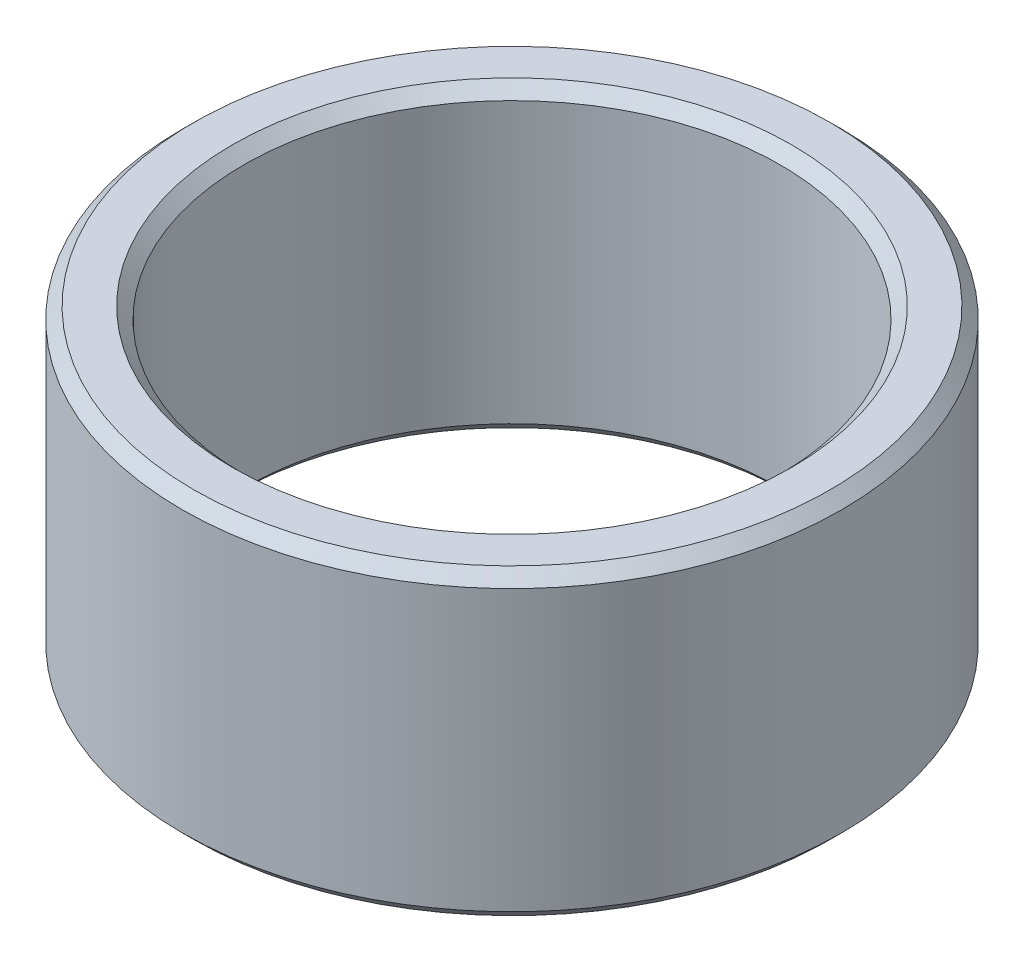
ISO-10303-21;
HEADER;
FILE_DESCRIPTION(('STEP AP214'),'2;1');
FILE_NAME('part.step','',(''),(''),'','','');
FILE_SCHEMA(('AUTOMOTIVE_DESIGN { 1 0 10303 214 1 1 1 1 }'));
ENDSEC;
DATA;
#1=APPLICATION_CONTEXT('core data for automotive mechanical design processes');
#2=APPLICATION_PROTOCOL_DEFINITION('international standard','automotive_design',2000,#1);
#3=PRODUCT_CONTEXT('',#1,'mechanical');
#4=PRODUCT('Part','Part','',(#3));
#5=PRODUCT_RELATED_PRODUCT_CATEGORY('part','',(#4));
#6=PRODUCT_DEFINITION_FORMATION('','',#4);
#7=PRODUCT_DEFINITION_CONTEXT('part definition',#1,'design');
#8=PRODUCT_DEFINITION('design','',#6,#7);
#9=PRODUCT_DEFINITION_SHAPE('','',#8);
#10=(LENGTH_UNIT() NAMED_UNIT(*) SI_UNIT(.MILLI.,.METRE.));
#11=(NAMED_UNIT(*) PLANE_ANGLE_UNIT() SI_UNIT($,.RADIAN.));
#12=(NAMED_UNIT(*) SI_UNIT($,.STERADIAN.) SOLID_ANGLE_UNIT());
#13=UNCERTAINTY_MEASURE_WITH_UNIT(LENGTH_MEASURE(1.E-05),#10,'distance_accuracy_value','');
#14=(GEOMETRIC_REPRESENTATION_CONTEXT(3) GLOBAL_UNCERTAINTY_ASSIGNED_CONTEXT((#13)) GLOBAL_UNIT_ASSIGNED_CONTEXT((#10,
#11,#12)) REPRESENTATION_CONTEXT('',''));
#15=CARTESIAN_POINT('',(0.,0.,0.));
#16=DIRECTION('',(0.,0.,1.));
#17=DIRECTION('',(1.,0.,0.));
#18=AXIS2_PLACEMENT_3D('',#15,#16,#17);
#19=CARTESIAN_POINT('',(0.,29.8582298915281,0.));
#20=DIRECTION('',(0.,-1.,0.));
#21=DIRECTION('',(0.,0.,-1.));
#22=AXIS2_PLACEMENT_3D('',#19,#20,#21);
#23=CYLINDRICAL_SURFACE('',#22,32.5);
#24=CARTESIAN_POINT('',(0.,1.13702534324426,0.));
#25=DIRECTION('',(0.,1.,0.));
#26=DIRECTION('',(0.,0.,1.));
#27=AXIS2_PLACEMENT_3D('',#24,#25,#26);
#28=CIRCLE('',#27,32.5);
#29=CARTESIAN_POINT('',(0.,1.13702534324426,32.5));
#30=VERTEX_POINT('',#29);
#31=EDGE_CURVE('E10',#30,#30,#28,.T.);
#32=ORIENTED_EDGE('',*,*,#31,.T.);
#33=EDGE_LOOP('',(#32));
#34=FACE_BOUND('',#33,.T.);
#35=CARTESIAN_POINT('',(0.,28.7212045482838,0.));
#36=DIRECTION('',(0.,1.,0.));
#37=DIRECTION('',(0.,0.,1.));
#38=AXIS2_PLACEMENT_3D('',#35,#36,#37);
#39=CIRCLE('',#38,32.5);
#40=CARTESIAN_POINT('',(0.,28.7212045482838,32.5));
#41=VERTEX_POINT('',#40);
#42=EDGE_CURVE('E50',#41,#41,#39,.F.);
#43=ORIENTED_EDGE('',*,*,#42,.T.);
#44=EDGE_LOOP('',(#43));
#45=FACE_BOUND('',#44,.T.);
#46=ADVANCED_FACE('F39',(#34,#45),#23,.T.);
#47=CARTESIAN_POINT('',(0.,29.8582298915281,0.));
#48=DIRECTION('',(0.,1.,0.));
#49=DIRECTION('',(0.,0.,1.));
#50=AXIS2_PLACEMENT_3D('',#47,#48,#49);
#51=PLANE('',#50);
#52=CARTESIAN_POINT('',(0.,29.8582298915281,0.));
#53=DIRECTION('',(0.,1.,0.));
#54=DIRECTION('',(0.,0.,1.));
#55=AXIS2_PLACEMENT_3D('',#52,#53,#54);
#56=CIRCLE('',#55,27.5584137759774);
#57=CARTESIAN_POINT('',(0.,29.8582298915281,27.5584137759774));
#58=VERTEX_POINT('',#57);
#59=EDGE_CURVE('E58',#58,#58,#56,.F.);
#60=ORIENTED_EDGE('',*,*,#59,.T.);
#61=EDGE_LOOP('',(#60));
#62=FACE_BOUND('',#61,.T.);
#63=CARTESIAN_POINT('',(0.,29.8582298915281,0.));
#64=DIRECTION('',(0.,1.,0.));
#65=DIRECTION('',(0.,0.,1.));
#66=AXIS2_PLACEMENT_3D('',#63,#64,#65);
#67=CIRCLE('',#66,31.3629746567557);
#68=CARTESIAN_POINT('',(0.,29.8582298915281,31.3629746567557));
#69=VERTEX_POINT('',#68);
#70=EDGE_CURVE('E61',#69,#69,#67,.T.);
#71=ORIENTED_EDGE('',*,*,#70,.T.);
#72=EDGE_LOOP('',(#71));
#73=FACE_BOUND('',#72,.T.);
#74=ADVANCED_FACE('F88',(#62,#73),#51,.T.);
#75=CARTESIAN_POINT('',(0.,0.,0.));
#76=DIRECTION('',(0.,1.,0.));
#77=DIRECTION('',(0.,0.,1.));
#78=AXIS2_PLACEMENT_3D('',#75,#76,#77);
#79=PLANE('',#78);
#80=CARTESIAN_POINT('',(0.,0.,0.));
#81=DIRECTION('',(0.,1.,0.));
#82=DIRECTION('',(0.,0.,1.));
#83=AXIS2_PLACEMENT_3D('',#80,#81,#82);
#84=CIRCLE('',#83,27.5584137759773);
#85=CARTESIAN_POINT('',(0.,0.,27.5584137759773));
#86=VERTEX_POINT('',#85);
#87=EDGE_CURVE('E51',#86,#86,#84,.T.);
#88=ORIENTED_EDGE('',*,*,#87,.T.);
#89=EDGE_LOOP('',(#88));
#90=FACE_BOUND('',#89,.T.);
#91=CARTESIAN_POINT('',(0.,0.,0.));
#92=DIRECTION('',(0.,1.,0.));
#93=DIRECTION('',(0.,0.,1.));
#94=AXIS2_PLACEMENT_3D('',#91,#92,#93);
#95=CIRCLE('',#94,31.3629746567557);
#96=CARTESIAN_POINT('',(0.,0.,31.3629746567557));
#97=VERTEX_POINT('',#96);
#98=EDGE_CURVE('E54',#97,#97,#95,.F.);
#99=ORIENTED_EDGE('',*,*,#98,.T.);
#100=EDGE_LOOP('',(#99));
#101=FACE_BOUND('',#100,.T.);
#102=ADVANCED_FACE('F83',(#90,#101),#79,.F.);
#103=CARTESIAN_POINT('',(0.,29.8582298915281,0.));
#104=DIRECTION('',(0.,-1.,0.));
#105=DIRECTION('',(0.,0.,-1.));
#106=AXIS2_PLACEMENT_3D('',#103,#104,#105);
#107=CYLINDRICAL_SURFACE('',#106,26.4213884327331);
#108=CARTESIAN_POINT('',(0.,28.7212045482838,0.));
#109=DIRECTION('',(0.,1.,0.));
#110=DIRECTION('',(0.,0.,1.));
#111=AXIS2_PLACEMENT_3D('',#108,#109,#110);
#112=CIRCLE('',#111,26.4213884327331);
#113=CARTESIAN_POINT('',(0.,28.7212045482838,26.4213884327331));
#114=VERTEX_POINT('',#113);
#115=EDGE_CURVE('E67',#114,#114,#112,.T.);
#116=ORIENTED_EDGE('',*,*,#115,.T.);
#117=EDGE_LOOP('',(#116));
#118=FACE_BOUND('',#117,.T.);
#119=CARTESIAN_POINT('',(0.,1.13702534324427,0.));
#120=DIRECTION('',(0.,1.,0.));
#121=DIRECTION('',(0.,0.,1.));
#122=AXIS2_PLACEMENT_3D('',#119,#120,#121);
#123=CIRCLE('',#122,26.4213884327331);
#124=CARTESIAN_POINT('',(0.,1.13702534324427,26.4213884327331));
#125=VERTEX_POINT('',#124);
#126=EDGE_CURVE('E69',#125,#125,#123,.F.);
#127=ORIENTED_EDGE('',*,*,#126,.T.);
#128=EDGE_LOOP('',(#127));
#129=FACE_BOUND('',#128,.T.);
#130=ADVANCED_FACE('F71',(#118,#129),#107,.F.);
#131=CARTESIAN_POINT('',(0.,28.7212045482838,0.));
#132=DIRECTION('',(0.,1.,0.));
#133=DIRECTION('',(0.,0.,1.));
#134=AXIS2_PLACEMENT_3D('',#131,#132,#133);
#135=CONICAL_SURFACE('',#134,26.4213884327331,0.785398163397456);
#136=ORIENTED_EDGE('',*,*,#59,.F.);
#137=EDGE_LOOP('',(#136));
#138=FACE_BOUND('',#137,.T.);
#139=ORIENTED_EDGE('',*,*,#115,.F.);
#140=EDGE_LOOP('',(#139));
#141=FACE_BOUND('',#140,.T.);
#142=ADVANCED_FACE('F77',(#138,#141),#135,.F.);
#143=CARTESIAN_POINT('',(0.,0.,0.));
#144=DIRECTION('',(0.,-1.,0.));
#145=DIRECTION('',(0.,0.,-1.));
#146=AXIS2_PLACEMENT_3D('',#143,#144,#145);
#147=CONICAL_SURFACE('',#146,27.5584137759773,0.785398163397444);
#148=ORIENTED_EDGE('',*,*,#126,.F.);
#149=EDGE_LOOP('',(#148));
#150=FACE_BOUND('',#149,.T.);
#151=ORIENTED_EDGE('',*,*,#87,.F.);
#152=EDGE_LOOP('',(#151));
#153=FACE_BOUND('',#152,.T.);
#154=ADVANCED_FACE('F73',(#150,#153),#147,.F.);
#155=CARTESIAN_POINT('',(0.,1.13702534324426,0.));
#156=DIRECTION('',(0.,1.,0.));
#157=DIRECTION('',(0.,0.,1.));
#158=AXIS2_PLACEMENT_3D('',#155,#156,#157);
#159=CONICAL_SURFACE('',#158,32.5,0.785398163397454);
#160=ORIENTED_EDGE('',*,*,#98,.F.);
#161=EDGE_LOOP('',(#160));
#162=FACE_BOUND('',#161,.T.);
#163=ORIENTED_EDGE('',*,*,#31,.F.);
#164=EDGE_LOOP('',(#163));
#165=FACE_BOUND('',#164,.T.);
#166=ADVANCED_FACE('F76',(#162,#165),#159,.T.);
#167=CARTESIAN_POINT('',(0.,29.8582298915281,0.));
#168=DIRECTION('',(0.,-1.,0.));
#169=DIRECTION('',(0.,0.,-1.));
#170=AXIS2_PLACEMENT_3D('',#167,#168,#169);
#171=CONICAL_SURFACE('',#170,31.3629746567557,0.785398163397442);
#172=ORIENTED_EDGE('',*,*,#42,.F.);
#173=EDGE_LOOP('',(#172));
#174=FACE_BOUND('',#173,.T.);
#175=ORIENTED_EDGE('',*,*,#70,.F.);
#176=EDGE_LOOP('',(#175));
#177=FACE_BOUND('',#176,.T.);
#178=ADVANCED_FACE('F45',(#174,#177),#171,.T.);
#179=CLOSED_SHELL('',(#46,#74,#102,#130,#142,#154,#166,#178));
#180=MANIFOLD_SOLID_BREP('B2',#179);
#181=ADVANCED_BREP_SHAPE_REPRESENTATION('',(#18,#180),#14);
#182=SHAPE_DEFINITION_REPRESENTATION(#9,#181);
ENDSEC;
END-ISO-10303-21;
